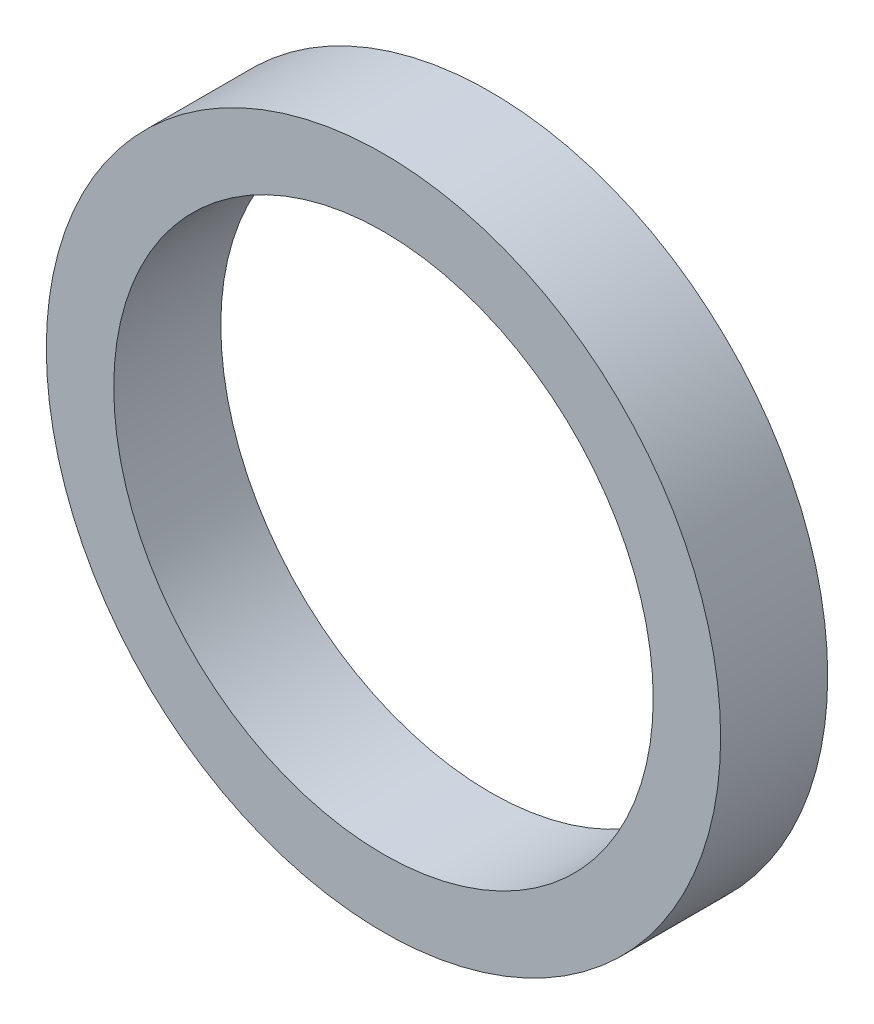
ISO-10303-21;
HEADER;
FILE_DESCRIPTION(('STEP AP214'),'2;1');
FILE_NAME('part.step','',(''),(''),'','','');
FILE_SCHEMA(('AUTOMOTIVE_DESIGN { 1 0 10303 214 1 1 1 1 }'));
ENDSEC;
DATA;
#1=APPLICATION_CONTEXT('core data for automotive mechanical design processes');
#2=APPLICATION_PROTOCOL_DEFINITION('international standard','automotive_design',2000,#1);
#3=PRODUCT_CONTEXT('',#1,'mechanical');
#4=PRODUCT('Part','Part','',(#3));
#5=PRODUCT_RELATED_PRODUCT_CATEGORY('part','',(#4));
#6=PRODUCT_DEFINITION_FORMATION('','',#4);
#7=PRODUCT_DEFINITION_CONTEXT('part definition',#1,'design');
#8=PRODUCT_DEFINITION('design','',#6,#7);
#9=PRODUCT_DEFINITION_SHAPE('','',#8);
#10=(LENGTH_UNIT() NAMED_UNIT(*) SI_UNIT(.MILLI.,.METRE.));
#11=(NAMED_UNIT(*) PLANE_ANGLE_UNIT() SI_UNIT($,.RADIAN.));
#12=(NAMED_UNIT(*) SI_UNIT($,.STERADIAN.) SOLID_ANGLE_UNIT());
#13=UNCERTAINTY_MEASURE_WITH_UNIT(LENGTH_MEASURE(1.E-05),#10,'distance_accuracy_value','');
#14=(GEOMETRIC_REPRESENTATION_CONTEXT(3) GLOBAL_UNCERTAINTY_ASSIGNED_CONTEXT((#13)) GLOBAL_UNIT_ASSIGNED_CONTEXT((#10,
#11,#12)) REPRESENTATION_CONTEXT('',''));
#15=CARTESIAN_POINT('',(0.,0.,0.));
#16=DIRECTION('',(0.,0.,1.));
#17=DIRECTION('',(1.,0.,0.));
#18=AXIS2_PLACEMENT_3D('',#15,#16,#17);
#19=CARTESIAN_POINT('',(0.,0.,1.5875));
#20=DIRECTION('',(0.,0.,1.));
#21=DIRECTION('',(1.,0.,0.));
#22=AXIS2_PLACEMENT_3D('',#19,#20,#21);
#23=PLANE('',#22);
#24=CARTESIAN_POINT('',(0.,0.,1.5875));
#25=DIRECTION('',(0.,0.,1.));
#26=DIRECTION('',(1.,0.,0.));
#27=AXIS2_PLACEMENT_3D('',#24,#25,#26);
#28=CIRCLE('',#27,5.);
#29=CARTESIAN_POINT('',(5.,0.,1.5875));
#30=VERTEX_POINT('',#29);
#31=EDGE_CURVE('E10',#30,#30,#28,.T.);
#32=ORIENTED_EDGE('',*,*,#31,.T.);
#33=EDGE_LOOP('',(#32));
#34=FACE_BOUND('',#33,.T.);
#35=CARTESIAN_POINT('',(0.,0.,1.5875));
#36=DIRECTION('',(0.,0.,1.));
#37=DIRECTION('',(1.,0.,0.));
#38=AXIS2_PLACEMENT_3D('',#35,#36,#37);
#39=CIRCLE('',#38,4.);
#40=CARTESIAN_POINT('',(4.,0.,1.5875));
#41=VERTEX_POINT('',#40);
#42=EDGE_CURVE('E43',#41,#41,#39,.T.);
#43=ORIENTED_EDGE('',*,*,#42,.F.);
#44=EDGE_LOOP('',(#43));
#45=FACE_BOUND('',#44,.T.);
#46=ADVANCED_FACE('F32',(#34,#45),#23,.T.);
#47=CARTESIAN_POINT('',(0.,0.,0.));
#48=DIRECTION('',(0.,0.,1.));
#49=DIRECTION('',(1.,0.,0.));
#50=AXIS2_PLACEMENT_3D('',#47,#48,#49);
#51=PLANE('',#50);
#52=CARTESIAN_POINT('',(0.,0.,0.));
#53=DIRECTION('',(0.,0.,1.));
#54=DIRECTION('',(1.,0.,0.));
#55=AXIS2_PLACEMENT_3D('',#52,#53,#54);
#56=CIRCLE('',#55,5.);
#57=CARTESIAN_POINT('',(5.,0.,0.));
#58=VERTEX_POINT('',#57);
#59=EDGE_CURVE('E36',#58,#58,#56,.T.);
#60=ORIENTED_EDGE('',*,*,#59,.F.);
#61=EDGE_LOOP('',(#60));
#62=FACE_BOUND('',#61,.T.);
#63=CARTESIAN_POINT('',(0.,0.,0.));
#64=DIRECTION('',(0.,0.,1.));
#65=DIRECTION('',(1.,0.,0.));
#66=AXIS2_PLACEMENT_3D('',#63,#64,#65);
#67=CIRCLE('',#66,4.);
#68=CARTESIAN_POINT('',(4.,0.,0.));
#69=VERTEX_POINT('',#68);
#70=EDGE_CURVE('E45',#69,#69,#67,.T.);
#71=ORIENTED_EDGE('',*,*,#70,.T.);
#72=EDGE_LOOP('',(#71));
#73=FACE_BOUND('',#72,.T.);
#74=ADVANCED_FACE('F55',(#62,#73),#51,.F.);
#75=CARTESIAN_POINT('',(0.,0.,1.5875));
#76=DIRECTION('',(0.,0.,-1.));
#77=DIRECTION('',(-1.,0.,0.));
#78=AXIS2_PLACEMENT_3D('',#75,#76,#77);
#79=CYLINDRICAL_SURFACE('',#78,5.);
#80=ORIENTED_EDGE('',*,*,#31,.F.);
#81=EDGE_LOOP('',(#80));
#82=FACE_BOUND('',#81,.T.);
#83=ORIENTED_EDGE('',*,*,#59,.T.);
#84=EDGE_LOOP('',(#83));
#85=FACE_BOUND('',#84,.T.);
#86=ADVANCED_FACE('F34',(#82,#85),#79,.T.);
#87=CARTESIAN_POINT('',(0.,0.,1.5875));
#88=DIRECTION('',(0.,0.,-1.));
#89=DIRECTION('',(-1.,0.,0.));
#90=AXIS2_PLACEMENT_3D('',#87,#88,#89);
#91=CYLINDRICAL_SURFACE('',#90,4.);
#92=ORIENTED_EDGE('',*,*,#42,.T.);
#93=EDGE_LOOP('',(#92));
#94=FACE_BOUND('',#93,.T.);
#95=ORIENTED_EDGE('',*,*,#70,.F.);
#96=EDGE_LOOP('',(#95));
#97=FACE_BOUND('',#96,.T.);
#98=ADVANCED_FACE('F51',(#94,#97),#91,.F.);
#99=CLOSED_SHELL('',(#46,#74,#86,#98));
#100=MANIFOLD_SOLID_BREP('B2',#99);
#101=ADVANCED_BREP_SHAPE_REPRESENTATION('',(#18,#100),#14);
#102=SHAPE_DEFINITION_REPRESENTATION(#9,#101);
ENDSEC;
END-ISO-10303-21;
